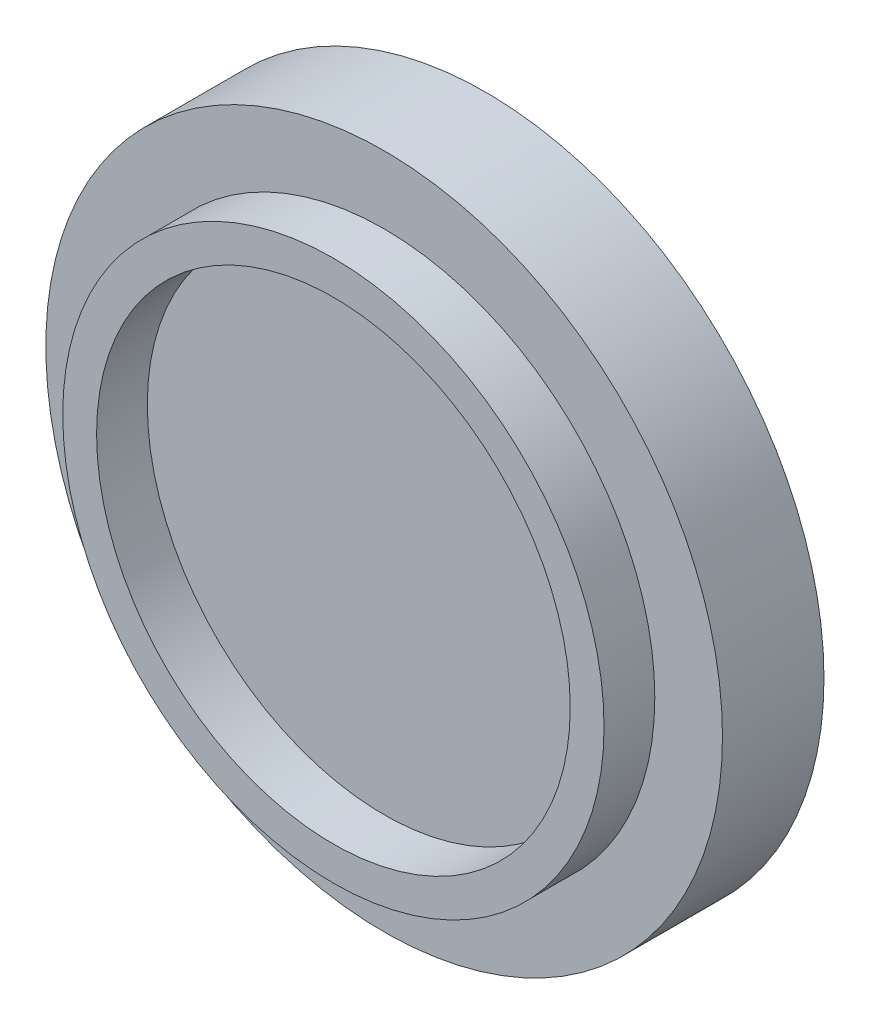
ISO-10303-21;
HEADER;
FILE_DESCRIPTION(('STEP AP214'),'2;1');
FILE_NAME('part.step','',(''),(''),'','','');
FILE_SCHEMA(('AUTOMOTIVE_DESIGN { 1 0 10303 214 1 1 1 1 }'));
ENDSEC;
DATA;
#1=APPLICATION_CONTEXT('core data for automotive mechanical design processes');
#2=APPLICATION_PROTOCOL_DEFINITION('international standard','automotive_design',2000,#1);
#3=PRODUCT_CONTEXT('',#1,'mechanical');
#4=PRODUCT('Part','Part','',(#3));
#5=PRODUCT_RELATED_PRODUCT_CATEGORY('part','',(#4));
#6=PRODUCT_DEFINITION_FORMATION('','',#4);
#7=PRODUCT_DEFINITION_CONTEXT('part definition',#1,'design');
#8=PRODUCT_DEFINITION('design','',#6,#7);
#9=PRODUCT_DEFINITION_SHAPE('','',#8);
#10=(LENGTH_UNIT() NAMED_UNIT(*) SI_UNIT(.MILLI.,.METRE.));
#11=(NAMED_UNIT(*) PLANE_ANGLE_UNIT() SI_UNIT($,.RADIAN.));
#12=(NAMED_UNIT(*) SI_UNIT($,.STERADIAN.) SOLID_ANGLE_UNIT());
#13=UNCERTAINTY_MEASURE_WITH_UNIT(LENGTH_MEASURE(1.E-05),#10,'distance_accuracy_value','');
#14=(GEOMETRIC_REPRESENTATION_CONTEXT(3) GLOBAL_UNCERTAINTY_ASSIGNED_CONTEXT((#13)) GLOBAL_UNIT_ASSIGNED_CONTEXT((#10,
#11,#12)) REPRESENTATION_CONTEXT('',''));
#15=CARTESIAN_POINT('',(0.,0.,0.));
#16=DIRECTION('',(0.,0.,1.));
#17=DIRECTION('',(1.,0.,0.));
#18=AXIS2_PLACEMENT_3D('',#15,#16,#17);
#19=CARTESIAN_POINT('',(0.,0.,30.));
#20=DIRECTION('',(0.,0.,-1.));
#21=DIRECTION('',(-1.,0.,0.));
#22=AXIS2_PLACEMENT_3D('',#19,#20,#21);
#23=CYLINDRICAL_SURFACE('',#22,100.);
#24=CARTESIAN_POINT('',(0.,0.,30.));
#25=DIRECTION('',(0.,0.,1.));
#26=DIRECTION('',(1.,0.,0.));
#27=AXIS2_PLACEMENT_3D('',#24,#25,#26);
#28=CIRCLE('',#27,100.);
#29=CARTESIAN_POINT('',(100.,0.,30.));
#30=VERTEX_POINT('',#29);
#31=EDGE_CURVE('E36',#30,#30,#28,.T.);
#32=ORIENTED_EDGE('',*,*,#31,.F.);
#33=EDGE_LOOP('',(#32));
#34=FACE_BOUND('',#33,.T.);
#35=CARTESIAN_POINT('',(0.,0.,0.));
#36=DIRECTION('',(0.,0.,1.));
#37=DIRECTION('',(1.,0.,0.));
#38=AXIS2_PLACEMENT_3D('',#35,#36,#37);
#39=CIRCLE('',#38,100.);
#40=CARTESIAN_POINT('',(100.,0.,0.));
#41=VERTEX_POINT('',#40);
#42=EDGE_CURVE('E40',#41,#41,#39,.T.);
#43=ORIENTED_EDGE('',*,*,#42,.T.);
#44=EDGE_LOOP('',(#43));
#45=FACE_BOUND('',#44,.T.);
#46=ADVANCED_FACE('F30',(#34,#45),#23,.T.);
#47=CARTESIAN_POINT('',(0.,0.,30.));
#48=DIRECTION('',(0.,0.,1.));
#49=DIRECTION('',(1.,0.,0.));
#50=AXIS2_PLACEMENT_3D('',#47,#48,#49);
#51=PLANE('',#50);
#52=CARTESIAN_POINT('',(0.,0.,30.));
#53=DIRECTION('',(0.,0.,1.));
#54=DIRECTION('',(1.,0.,0.));
#55=AXIS2_PLACEMENT_3D('',#52,#53,#54);
#56=CIRCLE('',#55,80.);
#57=CARTESIAN_POINT('',(80.,0.,30.));
#58=VERTEX_POINT('',#57);
#59=EDGE_CURVE('E47',#58,#58,#56,.T.);
#60=ORIENTED_EDGE('',*,*,#59,.F.);
#61=EDGE_LOOP('',(#60));
#62=FACE_BOUND('',#61,.T.);
#63=ORIENTED_EDGE('',*,*,#31,.T.);
#64=EDGE_LOOP('',(#63));
#65=FACE_BOUND('',#64,.T.);
#66=ADVANCED_FACE('F70',(#62,#65),#51,.T.);
#67=CARTESIAN_POINT('',(0.,0.,0.));
#68=DIRECTION('',(0.,0.,1.));
#69=DIRECTION('',(1.,0.,0.));
#70=AXIS2_PLACEMENT_3D('',#67,#68,#69);
#71=PLANE('',#70);
#72=ORIENTED_EDGE('',*,*,#42,.F.);
#73=EDGE_LOOP('',(#72));
#74=FACE_BOUND('',#73,.T.);
#75=ADVANCED_FACE('F61',(#74),#71,.F.);
#76=CARTESIAN_POINT('',(0.,0.,45.));
#77=DIRECTION('',(0.,0.,1.));
#78=DIRECTION('',(1.,0.,0.));
#79=AXIS2_PLACEMENT_3D('',#76,#77,#78);
#80=PLANE('',#79);
#81=CARTESIAN_POINT('',(0.,0.,45.));
#82=DIRECTION('',(0.,0.,1.));
#83=DIRECTION('',(1.,0.,0.));
#84=AXIS2_PLACEMENT_3D('',#81,#82,#83);
#85=CIRCLE('',#84,80.);
#86=CARTESIAN_POINT('',(80.,0.,45.));
#87=VERTEX_POINT('',#86);
#88=EDGE_CURVE('E45',#87,#87,#85,.T.);
#89=ORIENTED_EDGE('',*,*,#88,.T.);
#90=EDGE_LOOP('',(#89));
#91=FACE_BOUND('',#90,.T.);
#92=CARTESIAN_POINT('',(0.,0.,45.));
#93=DIRECTION('',(0.,0.,1.));
#94=DIRECTION('',(1.,0.,0.));
#95=AXIS2_PLACEMENT_3D('',#92,#93,#94);
#96=CIRCLE('',#95,70.);
#97=CARTESIAN_POINT('',(70.,0.,45.));
#98=VERTEX_POINT('',#97);
#99=EDGE_CURVE('E50',#98,#98,#96,.T.);
#100=ORIENTED_EDGE('',*,*,#99,.F.);
#101=EDGE_LOOP('',(#100));
#102=FACE_BOUND('',#101,.T.);
#103=ADVANCED_FACE('F58',(#91,#102),#80,.T.);
#104=CARTESIAN_POINT('',(0.,0.,45.));
#105=DIRECTION('',(0.,0.,-1.));
#106=DIRECTION('',(-1.,0.,0.));
#107=AXIS2_PLACEMENT_3D('',#104,#105,#106);
#108=CYLINDRICAL_SURFACE('',#107,80.);
#109=ORIENTED_EDGE('',*,*,#88,.F.);
#110=EDGE_LOOP('',(#109));
#111=FACE_BOUND('',#110,.T.);
#112=ORIENTED_EDGE('',*,*,#59,.T.);
#113=EDGE_LOOP('',(#112));
#114=FACE_BOUND('',#113,.T.);
#115=ADVANCED_FACE('F60',(#111,#114),#108,.T.);
#116=CARTESIAN_POINT('',(0.,0.,45.));
#117=DIRECTION('',(0.,0.,-1.));
#118=DIRECTION('',(-1.,0.,0.));
#119=AXIS2_PLACEMENT_3D('',#116,#117,#118);
#120=CYLINDRICAL_SURFACE('',#119,70.);
#121=ORIENTED_EDGE('',*,*,#99,.T.);
#122=EDGE_LOOP('',(#121));
#123=FACE_BOUND('',#122,.T.);
#124=CARTESIAN_POINT('',(0.,0.,30.));
#125=DIRECTION('',(0.,0.,1.));
#126=DIRECTION('',(1.,0.,0.));
#127=AXIS2_PLACEMENT_3D('',#124,#125,#126);
#128=CIRCLE('',#127,70.);
#129=CARTESIAN_POINT('',(70.,0.,30.));
#130=VERTEX_POINT('',#129);
#131=EDGE_CURVE('E10',#130,#130,#128,.F.);
#132=ORIENTED_EDGE('',*,*,#131,.T.);
#133=EDGE_LOOP('',(#132));
#134=FACE_BOUND('',#133,.T.);
#135=ADVANCED_FACE('F56',(#123,#134),#120,.F.);
#136=ORIENTED_EDGE('',*,*,#131,.F.);
#137=EDGE_LOOP('',(#136));
#138=FACE_BOUND('',#137,.T.);
#139=ADVANCED_FACE('F80',(#138),#51,.T.);
#140=CLOSED_SHELL('',(#46,#66,#75,#103,#115,#135,#139));
#141=MANIFOLD_SOLID_BREP('B2',#140);
#142=ADVANCED_BREP_SHAPE_REPRESENTATION('',(#18,#141),#14);
#143=SHAPE_DEFINITION_REPRESENTATION(#9,#142);
ENDSEC;
END-ISO-10303-21;
